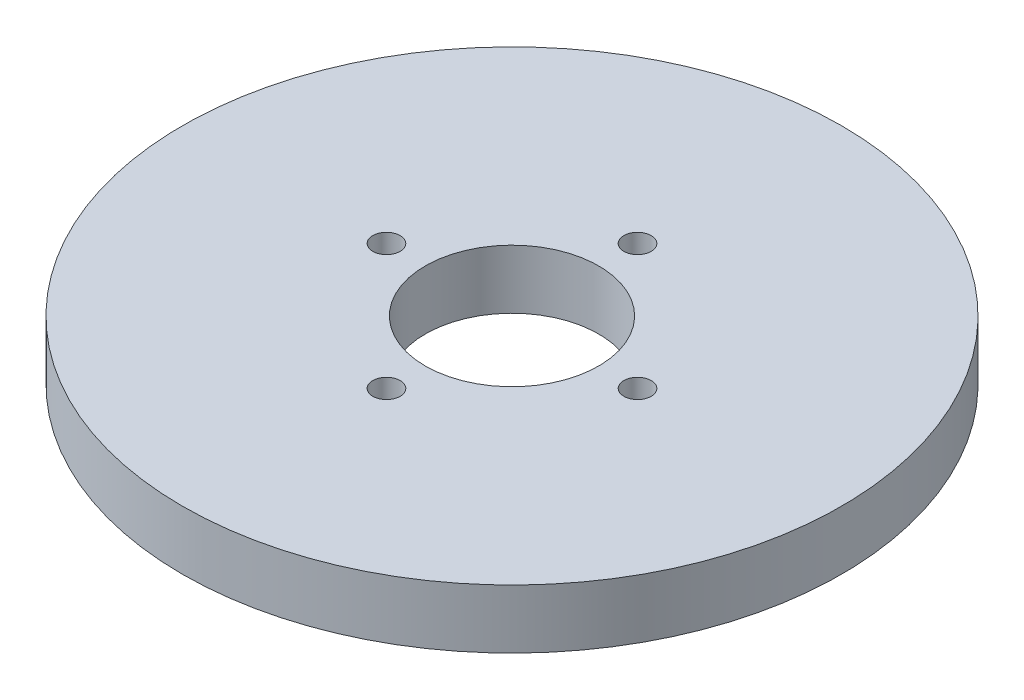
ISO-10303-21;
HEADER;
FILE_DESCRIPTION(('STEP AP214'),'2;1');
FILE_NAME('part.step','',(''),(''),'','','');
FILE_SCHEMA(('AUTOMOTIVE_DESIGN { 1 0 10303 214 1 1 1 1 }'));
ENDSEC;
DATA;
#1=APPLICATION_CONTEXT('core data for automotive mechanical design processes');
#2=APPLICATION_PROTOCOL_DEFINITION('international standard','automotive_design',2000,#1);
#3=PRODUCT_CONTEXT('',#1,'mechanical');
#4=PRODUCT('Part','Part','',(#3));
#5=PRODUCT_RELATED_PRODUCT_CATEGORY('part','',(#4));
#6=PRODUCT_DEFINITION_FORMATION('','',#4);
#7=PRODUCT_DEFINITION_CONTEXT('part definition',#1,'design');
#8=PRODUCT_DEFINITION('design','',#6,#7);
#9=PRODUCT_DEFINITION_SHAPE('','',#8);
#10=(LENGTH_UNIT() NAMED_UNIT(*) SI_UNIT(.MILLI.,.METRE.));
#11=(NAMED_UNIT(*) PLANE_ANGLE_UNIT() SI_UNIT($,.RADIAN.));
#12=(NAMED_UNIT(*) SI_UNIT($,.STERADIAN.) SOLID_ANGLE_UNIT());
#13=UNCERTAINTY_MEASURE_WITH_UNIT(LENGTH_MEASURE(1.E-05),#10,'distance_accuracy_value','');
#14=(GEOMETRIC_REPRESENTATION_CONTEXT(3) GLOBAL_UNCERTAINTY_ASSIGNED_CONTEXT((#13)) GLOBAL_UNIT_ASSIGNED_CONTEXT((#10,
#11,#12)) REPRESENTATION_CONTEXT('',''));
#15=CARTESIAN_POINT('',(0.,0.,0.));
#16=DIRECTION('',(0.,0.,1.));
#17=DIRECTION('',(1.,0.,0.));
#18=AXIS2_PLACEMENT_3D('',#15,#16,#17);
#19=CARTESIAN_POINT('',(0.,17.,0.));
#20=DIRECTION('',(0.,-1.,0.));
#21=DIRECTION('',(0.,0.,-1.));
#22=AXIS2_PLACEMENT_3D('',#19,#20,#21);
#23=CYLINDRICAL_SURFACE('',#22,95.);
#24=CARTESIAN_POINT('',(0.,17.,0.));
#25=DIRECTION('',(0.,1.,0.));
#26=DIRECTION('',(0.,0.,1.));
#27=AXIS2_PLACEMENT_3D('',#24,#25,#26);
#28=CIRCLE('',#27,95.);
#29=CARTESIAN_POINT('',(0.,17.,95.));
#30=VERTEX_POINT('',#29);
#31=EDGE_CURVE('E10',#30,#30,#28,.T.);
#32=ORIENTED_EDGE('',*,*,#31,.F.);
#33=EDGE_LOOP('',(#32));
#34=FACE_BOUND('',#33,.T.);
#35=CARTESIAN_POINT('',(0.,0.,0.));
#36=DIRECTION('',(0.,1.,0.));
#37=DIRECTION('',(0.,0.,1.));
#38=AXIS2_PLACEMENT_3D('',#35,#36,#37);
#39=CIRCLE('',#38,95.);
#40=CARTESIAN_POINT('',(0.,0.,95.));
#41=VERTEX_POINT('',#40);
#42=EDGE_CURVE('E37',#41,#41,#39,.T.);
#43=ORIENTED_EDGE('',*,*,#42,.T.);
#44=EDGE_LOOP('',(#43));
#45=FACE_BOUND('',#44,.T.);
#46=ADVANCED_FACE('F40',(#34,#45),#23,.T.);
#47=CARTESIAN_POINT('',(0.,17.,0.));
#48=DIRECTION('',(0.,1.,0.));
#49=DIRECTION('',(0.,0.,1.));
#50=AXIS2_PLACEMENT_3D('',#47,#48,#49);
#51=PLANE('',#50);
#52=CARTESIAN_POINT('',(1.26342627925304E-13,17.,36.1859668329679));
#53=DIRECTION('',(0.,1.,0.));
#54=DIRECTION('',(1.,0.,0.));
#55=AXIS2_PLACEMENT_3D('',#52,#53,#54);
#56=CIRCLE('',#55,3.94443448439461);
#57=CARTESIAN_POINT('',(3.94443448439474,17.,36.1859668329678));
#58=VERTEX_POINT('',#57);
#59=EDGE_CURVE('E71',#58,#58,#56,.T.);
#60=ORIENTED_EDGE('',*,*,#59,.F.);
#61=EDGE_LOOP('',(#60));
#62=FACE_BOUND('',#61,.T.);
#63=CARTESIAN_POINT('',(36.1859668329679,17.,0.));
#64=DIRECTION('',(0.,1.,0.));
#65=DIRECTION('',(0.,0.,-1.));
#66=AXIS2_PLACEMENT_3D('',#63,#64,#65);
#67=CIRCLE('',#66,3.94443448439461);
#68=CARTESIAN_POINT('',(36.1859668329679,17.,-3.94443448439461));
#69=VERTEX_POINT('',#68);
#70=EDGE_CURVE('E70',#69,#69,#67,.T.);
#71=ORIENTED_EDGE('',*,*,#70,.F.);
#72=EDGE_LOOP('',(#71));
#73=FACE_BOUND('',#72,.T.);
#74=CARTESIAN_POINT('',(-3.79027883775912E-13,17.,-36.1859668329679));
#75=DIRECTION('',(0.,1.,0.));
#76=DIRECTION('',(-1.,0.,0.));
#77=AXIS2_PLACEMENT_3D('',#74,#75,#76);
#78=CIRCLE('',#77,3.94443448439461);
#79=CARTESIAN_POINT('',(-3.94443448439499,17.,-36.1859668329678));
#80=VERTEX_POINT('',#79);
#81=EDGE_CURVE('E61',#80,#80,#78,.T.);
#82=ORIENTED_EDGE('',*,*,#81,.F.);
#83=EDGE_LOOP('',(#82));
#84=FACE_BOUND('',#83,.T.);
#85=CARTESIAN_POINT('',(-36.1859668329679,17.,0.));
#86=DIRECTION('',(0.,1.,0.));
#87=DIRECTION('',(0.,0.,1.));
#88=AXIS2_PLACEMENT_3D('',#85,#86,#87);
#89=CIRCLE('',#88,3.94443448439461);
#90=CARTESIAN_POINT('',(-36.1859668329679,17.,3.94443448439461));
#91=VERTEX_POINT('',#90);
#92=EDGE_CURVE('E54',#91,#91,#89,.T.);
#93=ORIENTED_EDGE('',*,*,#92,.F.);
#94=EDGE_LOOP('',(#93));
#95=FACE_BOUND('',#94,.T.);
#96=CARTESIAN_POINT('',(0.,17.,0.));
#97=DIRECTION('',(0.,1.,0.));
#98=DIRECTION('',(0.,0.,1.));
#99=AXIS2_PLACEMENT_3D('',#96,#97,#98);
#100=CIRCLE('',#99,25.);
#101=CARTESIAN_POINT('',(0.,17.,25.));
#102=VERTEX_POINT('',#101);
#103=EDGE_CURVE('E50',#102,#102,#100,.T.);
#104=ORIENTED_EDGE('',*,*,#103,.F.);
#105=EDGE_LOOP('',(#104));
#106=FACE_BOUND('',#105,.T.);
#107=ORIENTED_EDGE('',*,*,#31,.T.);
#108=EDGE_LOOP('',(#107));
#109=FACE_BOUND('',#108,.T.);
#110=ADVANCED_FACE('F86',(#62,#73,#84,#95,#106,#109),#51,.T.);
#111=CARTESIAN_POINT('',(0.,0.,0.));
#112=DIRECTION('',(0.,1.,0.));
#113=DIRECTION('',(0.,0.,1.));
#114=AXIS2_PLACEMENT_3D('',#111,#112,#113);
#115=PLANE('',#114);
#116=CARTESIAN_POINT('',(0.,0.,0.));
#117=DIRECTION('',(0.,1.,0.));
#118=DIRECTION('',(0.,0.,1.));
#119=AXIS2_PLACEMENT_3D('',#116,#117,#118);
#120=CIRCLE('',#119,25.);
#121=CARTESIAN_POINT('',(0.,0.,25.));
#122=VERTEX_POINT('',#121);
#123=EDGE_CURVE('E47',#122,#122,#120,.T.);
#124=ORIENTED_EDGE('',*,*,#123,.T.);
#125=EDGE_LOOP('',(#124));
#126=FACE_BOUND('',#125,.T.);
#127=ORIENTED_EDGE('',*,*,#42,.F.);
#128=EDGE_LOOP('',(#127));
#129=FACE_BOUND('',#128,.T.);
#130=ADVANCED_FACE('F93',(#126,#129),#115,.F.);
#131=CARTESIAN_POINT('',(0.,17.,0.));
#132=DIRECTION('',(0.,-1.,0.));
#133=DIRECTION('',(0.,0.,-1.));
#134=AXIS2_PLACEMENT_3D('',#131,#132,#133);
#135=CYLINDRICAL_SURFACE('',#134,25.);
#136=ORIENTED_EDGE('',*,*,#103,.T.);
#137=EDGE_LOOP('',(#136));
#138=FACE_BOUND('',#137,.T.);
#139=ORIENTED_EDGE('',*,*,#123,.F.);
#140=EDGE_LOOP('',(#139));
#141=FACE_BOUND('',#140,.T.);
#142=ADVANCED_FACE('F101',(#138,#141),#135,.F.);
#143=CARTESIAN_POINT('',(-36.1859668329679,1.22369133402348,0.));
#144=DIRECTION('',(0.,1.,0.));
#145=DIRECTION('',(0.,0.,1.));
#146=AXIS2_PLACEMENT_3D('',#143,#144,#145);
#147=CYLINDRICAL_SURFACE('',#146,3.94443448439461);
#148=CARTESIAN_POINT('',(-36.1859668329679,1.22369133402348,0.));
#149=DIRECTION('',(0.,1.,0.));
#150=DIRECTION('',(0.,0.,1.));
#151=AXIS2_PLACEMENT_3D('',#148,#149,#150);
#152=CIRCLE('',#151,3.94443448439461);
#153=CARTESIAN_POINT('',(-36.1859668329679,1.22369133402348,3.94443448439461));
#154=VERTEX_POINT('',#153);
#155=EDGE_CURVE('E55',#154,#154,#152,.T.);
#156=ORIENTED_EDGE('',*,*,#155,.F.);
#157=EDGE_LOOP('',(#156));
#158=FACE_BOUND('',#157,.T.);
#159=ORIENTED_EDGE('',*,*,#92,.T.);
#160=EDGE_LOOP('',(#159));
#161=FACE_BOUND('',#160,.T.);
#162=ADVANCED_FACE('F102',(#158,#161),#147,.F.);
#163=CARTESIAN_POINT('',(-36.1859668329679,1.22369133402348,0.));
#164=DIRECTION('',(0.,1.,0.));
#165=DIRECTION('',(0.,0.,1.));
#166=AXIS2_PLACEMENT_3D('',#163,#164,#165);
#167=PLANE('',#166);
#168=ORIENTED_EDGE('',*,*,#155,.T.);
#169=EDGE_LOOP('',(#168));
#170=FACE_BOUND('',#169,.T.);
#171=ADVANCED_FACE('F133',(#170),#167,.T.);
#172=CARTESIAN_POINT('',(-3.79027883775912E-13,1.22369133402348,-36.1859668329679));
#173=DIRECTION('',(0.,1.,0.));
#174=DIRECTION('',(0.,0.,1.));
#175=AXIS2_PLACEMENT_3D('',#172,#173,#174);
#176=CYLINDRICAL_SURFACE('',#175,3.94443448439461);
#177=CARTESIAN_POINT('',(-3.79027883775912E-13,1.22369133402348,-36.1859668329679));
#178=DIRECTION('',(0.,1.,0.));
#179=DIRECTION('',(-1.,0.,0.));
#180=AXIS2_PLACEMENT_3D('',#177,#178,#179);
#181=CIRCLE('',#180,3.94443448439461);
#182=CARTESIAN_POINT('',(-3.94443448439499,1.22369133402348,-36.1859668329678));
#183=VERTEX_POINT('',#182);
#184=EDGE_CURVE('E63',#183,#183,#181,.T.);
#185=ORIENTED_EDGE('',*,*,#184,.F.);
#186=EDGE_LOOP('',(#185));
#187=FACE_BOUND('',#186,.T.);
#188=ORIENTED_EDGE('',*,*,#81,.T.);
#189=EDGE_LOOP('',(#188));
#190=FACE_BOUND('',#189,.T.);
#191=ADVANCED_FACE('F142',(#187,#190),#176,.F.);
#192=CARTESIAN_POINT('',(-3.79027883775912E-13,1.22369133402348,-36.1859668329679));
#193=DIRECTION('',(0.,1.,0.));
#194=DIRECTION('',(-1.,0.,0.));
#195=AXIS2_PLACEMENT_3D('',#192,#193,#194);
#196=PLANE('',#195);
#197=ORIENTED_EDGE('',*,*,#184,.T.);
#198=EDGE_LOOP('',(#197));
#199=FACE_BOUND('',#198,.T.);
#200=ADVANCED_FACE('F156',(#199),#196,.T.);
#201=CARTESIAN_POINT('',(36.1859668329679,1.22369133402348,0.));
#202=DIRECTION('',(0.,1.,0.));
#203=DIRECTION('',(0.,0.,1.));
#204=AXIS2_PLACEMENT_3D('',#201,#202,#203);
#205=CYLINDRICAL_SURFACE('',#204,3.94443448439461);
#206=CARTESIAN_POINT('',(36.1859668329679,1.22369133402348,0.));
#207=DIRECTION('',(0.,1.,0.));
#208=DIRECTION('',(0.,0.,-1.));
#209=AXIS2_PLACEMENT_3D('',#206,#207,#208);
#210=CIRCLE('',#209,3.94443448439461);
#211=CARTESIAN_POINT('',(36.1859668329679,1.22369133402348,-3.94443448439461));
#212=VERTEX_POINT('',#211);
#213=EDGE_CURVE('E69',#212,#212,#210,.T.);
#214=ORIENTED_EDGE('',*,*,#213,.F.);
#215=EDGE_LOOP('',(#214));
#216=FACE_BOUND('',#215,.T.);
#217=ORIENTED_EDGE('',*,*,#70,.T.);
#218=EDGE_LOOP('',(#217));
#219=FACE_BOUND('',#218,.T.);
#220=ADVANCED_FACE('F164',(#216,#219),#205,.F.);
#221=CARTESIAN_POINT('',(36.1859668329679,1.22369133402348,0.));
#222=DIRECTION('',(0.,1.,0.));
#223=DIRECTION('',(0.,0.,-1.));
#224=AXIS2_PLACEMENT_3D('',#221,#222,#223);
#225=PLANE('',#224);
#226=ORIENTED_EDGE('',*,*,#213,.T.);
#227=EDGE_LOOP('',(#226));
#228=FACE_BOUND('',#227,.T.);
#229=ADVANCED_FACE('F83',(#228),#225,.T.);
#230=CARTESIAN_POINT('',(1.26342627925304E-13,1.22369133402348,36.1859668329679));
#231=DIRECTION('',(0.,1.,0.));
#232=DIRECTION('',(0.,0.,1.));
#233=AXIS2_PLACEMENT_3D('',#230,#231,#232);
#234=CYLINDRICAL_SURFACE('',#233,3.94443448439461);
#235=CARTESIAN_POINT('',(1.26342627925304E-13,1.22369133402348,36.1859668329679));
#236=DIRECTION('',(0.,1.,0.));
#237=DIRECTION('',(1.,0.,0.));
#238=AXIS2_PLACEMENT_3D('',#235,#236,#237);
#239=CIRCLE('',#238,3.94443448439461);
#240=CARTESIAN_POINT('',(3.94443448439474,1.22369133402348,36.1859668329678));
#241=VERTEX_POINT('',#240);
#242=EDGE_CURVE('E59',#241,#241,#239,.T.);
#243=ORIENTED_EDGE('',*,*,#242,.F.);
#244=EDGE_LOOP('',(#243));
#245=FACE_BOUND('',#244,.T.);
#246=ORIENTED_EDGE('',*,*,#59,.T.);
#247=EDGE_LOOP('',(#246));
#248=FACE_BOUND('',#247,.T.);
#249=ADVANCED_FACE('F81',(#245,#248),#234,.F.);
#250=CARTESIAN_POINT('',(1.26342627925304E-13,1.22369133402348,36.1859668329679));
#251=DIRECTION('',(0.,1.,0.));
#252=DIRECTION('',(1.,0.,0.));
#253=AXIS2_PLACEMENT_3D('',#250,#251,#252);
#254=PLANE('',#253);
#255=ORIENTED_EDGE('',*,*,#242,.T.);
#256=EDGE_LOOP('',(#255));
#257=FACE_BOUND('',#256,.T.);
#258=ADVANCED_FACE('F78',(#257),#254,.T.);
#259=CLOSED_SHELL('',(#46,#110,#130,#142,#162,#171,#191,#200,#220,#229,#249,#258));
#260=MANIFOLD_SOLID_BREP('B2',#259);
#261=ADVANCED_BREP_SHAPE_REPRESENTATION('',(#18,#260),#14);
#262=SHAPE_DEFINITION_REPRESENTATION(#9,#261);
ENDSEC;
END-ISO-10303-21;
